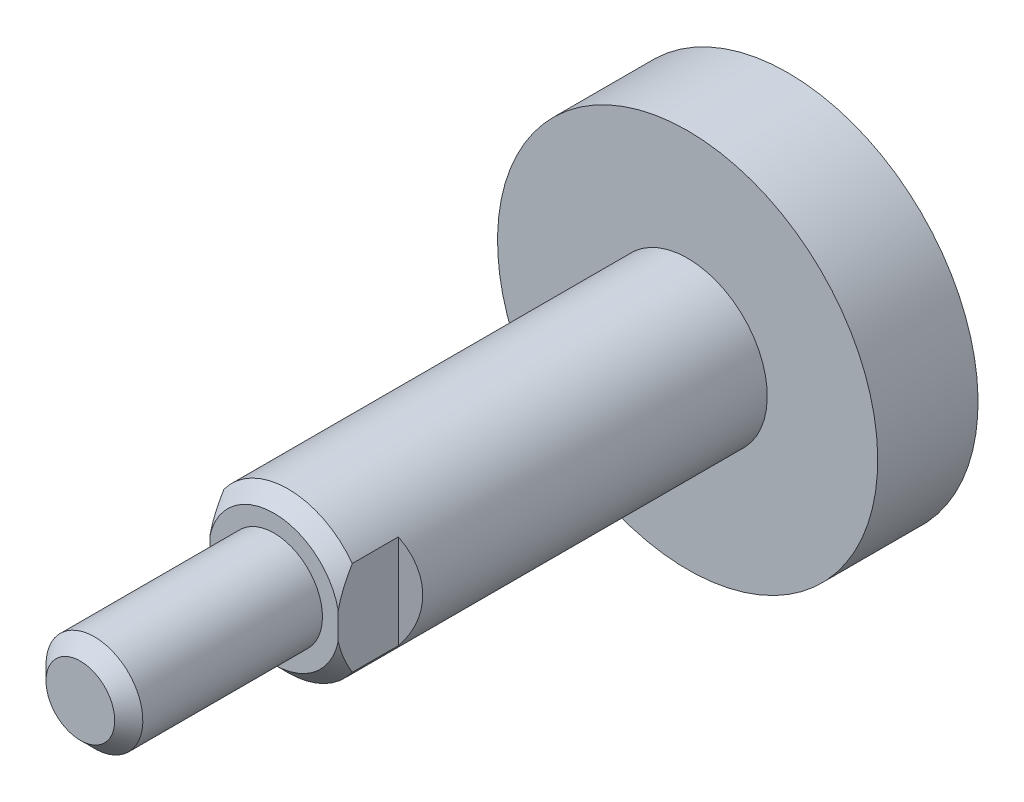
ISO-10303-21;
HEADER;
FILE_DESCRIPTION(('STEP AP214'),'2;1');
FILE_NAME('part.step','',(''),(''),'','','');
FILE_SCHEMA(('AUTOMOTIVE_DESIGN { 1 0 10303 214 1 1 1 1 }'));
ENDSEC;
DATA;
#1=APPLICATION_CONTEXT('core data for automotive mechanical design processes');
#2=APPLICATION_PROTOCOL_DEFINITION('international standard','automotive_design',2000,#1);
#3=PRODUCT_CONTEXT('',#1,'mechanical');
#4=PRODUCT('Part','Part','',(#3));
#5=PRODUCT_RELATED_PRODUCT_CATEGORY('part','',(#4));
#6=PRODUCT_DEFINITION_FORMATION('','',#4);
#7=PRODUCT_DEFINITION_CONTEXT('part definition',#1,'design');
#8=PRODUCT_DEFINITION('design','',#6,#7);
#9=PRODUCT_DEFINITION_SHAPE('','',#8);
#10=(LENGTH_UNIT() NAMED_UNIT(*) SI_UNIT(.MILLI.,.METRE.));
#11=(NAMED_UNIT(*) PLANE_ANGLE_UNIT() SI_UNIT($,.RADIAN.));
#12=(NAMED_UNIT(*) SI_UNIT($,.STERADIAN.) SOLID_ANGLE_UNIT());
#13=UNCERTAINTY_MEASURE_WITH_UNIT(LENGTH_MEASURE(1.E-05),#10,'distance_accuracy_value','');
#14=(GEOMETRIC_REPRESENTATION_CONTEXT(3) GLOBAL_UNCERTAINTY_ASSIGNED_CONTEXT((#13)) GLOBAL_UNIT_ASSIGNED_CONTEXT((#10,
#11,#12)) REPRESENTATION_CONTEXT('',''));
#15=CARTESIAN_POINT('',(0.,0.,0.));
#16=DIRECTION('',(0.,0.,1.));
#17=DIRECTION('',(1.,0.,0.));
#18=AXIS2_PLACEMENT_3D('',#15,#16,#17);
#19=CARTESIAN_POINT('',(0.,0.,35.266));
#20=DIRECTION('',(0.,0.,1.));
#21=DIRECTION('',(0.,-1.,0.));
#22=AXIS2_PLACEMENT_3D('',#19,#20,#21);
#23=PLANE('',#22);
#24=CARTESIAN_POINT('',(0.,0.,35.2659999999219));
#25=DIRECTION('',(0.,0.,-1.));
#26=DIRECTION('',(-1.,0.,0.));
#27=AXIS2_PLACEMENT_3D('',#24,#25,#26);
#28=CIRCLE('',#27,1.71299999999519);
#29=CARTESIAN_POINT('',(-1.71299999999519,0.,35.2659999999219));
#30=VERTEX_POINT('',#29);
#31=EDGE_CURVE('E20',#30,#30,#28,.T.);
#32=ORIENTED_EDGE('',*,*,#31,.F.);
#33=EDGE_LOOP('',(#32));
#34=FACE_BOUND('',#33,.T.);
#35=ADVANCED_FACE('F17',(#34),#23,.T.);
#36=CARTESIAN_POINT('',(0.,0.,34.5659999999839));
#37=DIRECTION('',(0.,0.,-1.));
#38=DIRECTION('',(-1.,0.,0.));
#39=AXIS2_PLACEMENT_3D('',#36,#37,#38);
#40=CONICAL_SURFACE('',#39,2.41299999993316,0.785398163397448);
#41=ORIENTED_EDGE('',*,*,#31,.T.);
#42=EDGE_LOOP('',(#41));
#43=FACE_BOUND('',#42,.T.);
#44=CARTESIAN_POINT('',(0.,0.,34.566));
#45=DIRECTION('',(0.,0.,-1.));
#46=DIRECTION('',(0.,1.,0.));
#47=AXIS2_PLACEMENT_3D('',#44,#45,#46);
#48=CIRCLE('',#47,2.413);
#49=CARTESIAN_POINT('',(0.,2.413,34.566));
#50=VERTEX_POINT('',#49);
#51=EDGE_CURVE('E72',#50,#50,#48,.T.);
#52=ORIENTED_EDGE('',*,*,#51,.F.);
#53=EDGE_LOOP('',(#52));
#54=FACE_BOUND('',#53,.T.);
#55=ADVANCED_FACE('F197',(#43,#54),#40,.T.);
#56=CARTESIAN_POINT('',(0.,0.,35.266));
#57=DIRECTION('',(0.,0.,-1.));
#58=DIRECTION('',(0.,1.,0.));
#59=AXIS2_PLACEMENT_3D('',#56,#57,#58);
#60=CYLINDRICAL_SURFACE('',#59,2.413);
#61=ORIENTED_EDGE('',*,*,#51,.T.);
#62=EDGE_LOOP('',(#61));
#63=FACE_BOUND('',#62,.T.);
#64=CARTESIAN_POINT('',(0.,0.,25.614));
#65=DIRECTION('',(0.,0.,-1.));
#66=DIRECTION('',(0.,1.,0.));
#67=AXIS2_PLACEMENT_3D('',#64,#65,#66);
#68=CIRCLE('',#67,2.413);
#69=CARTESIAN_POINT('',(0.,2.413,25.614));
#70=VERTEX_POINT('',#69);
#71=EDGE_CURVE('E71',#70,#70,#68,.F.);
#72=ORIENTED_EDGE('',*,*,#71,.T.);
#73=EDGE_LOOP('',(#72));
#74=FACE_BOUND('',#73,.T.);
#75=ADVANCED_FACE('F204',(#63,#74),#60,.T.);
#76=CARTESIAN_POINT('',(0.,0.,25.614));
#77=DIRECTION('',(0.,0.,-1.));
#78=DIRECTION('',(0.,1.,0.));
#79=AXIS2_PLACEMENT_3D('',#76,#77,#78);
#80=PLANE('',#79);
#81=ORIENTED_EDGE('',*,*,#71,.F.);
#82=EDGE_LOOP('',(#81));
#83=FACE_BOUND('',#82,.T.);
#84=DIRECTION('',(0.,1.,0.));
#85=VECTOR('',#84,1.);
#86=CARTESIAN_POINT('',(3.2,0.,25.614));
#87=LINE('',#86,#85);
#88=CARTESIAN_POINT('',(3.2,0.66810253703174,25.6140000000093));
#89=VERTEX_POINT('',#88);
#90=CARTESIAN_POINT('',(3.2,-0.668102537031729,25.6140000000093));
#91=VERTEX_POINT('',#90);
#92=EDGE_CURVE('E59',#89,#91,#87,.F.);
#93=ORIENTED_EDGE('',*,*,#92,.F.);
#94=CARTESIAN_POINT('',(0.,0.,25.6140000000187));
#95=DIRECTION('',(0.,0.,-1.));
#96=DIRECTION('',(0.,1.,0.));
#97=AXIS2_PLACEMENT_3D('',#94,#95,#96);
#98=CIRCLE('',#97,3.26899999998887);
#99=CARTESIAN_POINT('',(-3.2,0.668102537031733,25.6140000000093));
#100=VERTEX_POINT('',#99);
#101=EDGE_CURVE('E92',#100,#89,#98,.T.);
#102=ORIENTED_EDGE('',*,*,#101,.F.);
#103=DIRECTION('',(0.,1.,0.));
#104=VECTOR('',#103,1.);
#105=CARTESIAN_POINT('',(-3.2,-9.475,25.614));
#106=LINE('',#105,#104);
#107=CARTESIAN_POINT('',(-3.2,-0.668102537013458,25.6140000000131));
#108=VERTEX_POINT('',#107);
#109=EDGE_CURVE('E78',#100,#108,#106,.F.);
#110=ORIENTED_EDGE('',*,*,#109,.T.);
#111=CARTESIAN_POINT('',(0.,0.,25.6140000000187));
#112=DIRECTION('',(0.,0.,-1.));
#113=DIRECTION('',(0.,1.,0.));
#114=AXIS2_PLACEMENT_3D('',#111,#112,#113);
#115=CIRCLE('',#114,3.26899999998887);
#116=EDGE_CURVE('E76',#91,#108,#115,.T.);
#117=ORIENTED_EDGE('',*,*,#116,.F.);
#118=EDGE_LOOP('',(#93,#102,#110,#117));
#119=FACE_BOUND('',#118,.T.);
#120=ADVANCED_FACE('F77',(#83,#119),#80,.F.);
#121=CARTESIAN_POINT('',(0.,0.,24.9140000000807));
#122=DIRECTION('',(0.,0.,-1.));
#123=DIRECTION('',(0.,1.,0.));
#124=AXIS2_PLACEMENT_3D('',#121,#122,#123);
#125=CONICAL_SURFACE('',#124,3.96899999992684,0.785398163397448);
#126=CARTESIAN_POINT('',(-3.2,-0.668102537040877,25.6140000000075));
#127=CARTESIAN_POINT('',(-3.2,-0.791923989295427,25.5887118948215));
#128=CARTESIAN_POINT('',(-3.2,-0.91421443217869,25.5569533814341));
#129=CARTESIAN_POINT('',(-3.2,-1.15522323064115,25.4827867348097));
#130=CARTESIAN_POINT('',(-3.2,-1.27394966581364,25.4404051094269));
#131=CARTESIAN_POINT('',(-3.2,-1.50692397326224,25.3475394481761));
#132=CARTESIAN_POINT('',(-3.2,-1.62120166832552,25.2971285477306));
#133=CARTESIAN_POINT('',(-3.2,-1.84665634636372,25.1897204575844));
#134=CARTESIAN_POINT('',(-3.2,-1.95783200279579,25.1327205021723));
#135=CARTESIAN_POINT('',(-3.2,-2.11477722577384,25.0475447828539));
#136=CARTESIAN_POINT('',(-3.2,-2.1617013623651,25.0214620111321));
#137=CARTESIAN_POINT('',(-3.2,-2.25515024750113,24.9683835316657));
#138=CARTESIAN_POINT('',(-3.2,-2.30167405354123,24.9413861634533));
#139=CARTESIAN_POINT('',(-3.2,-2.34796954835779,24.9140000000056));
#140=B_SPLINE_CURVE_WITH_KNOTS('',3,(#126,#127,#128,#129,#130,#131,#132,#133,#134,#135,#136,
#137,#138,#139),.UNSPECIFIED.,.F.,.F.,(4,2,2,2,2,2,4),(0.,0.378663318902455,0.756391005201612,
1.13085654272106,1.50547983428745,1.66653163358814,1.82789340191387),.UNSPECIFIED.);
#141=CARTESIAN_POINT('',(-3.2,-2.34796954835613,24.9140000000028));
#142=VERTEX_POINT('',#141);
#143=EDGE_CURVE('E117',#108,#142,#140,.T.);
#144=ORIENTED_EDGE('',*,*,#143,.T.);
#145=CARTESIAN_POINT('',(0.,0.,24.914));
#146=DIRECTION('',(0.,0.,-1.));
#147=DIRECTION('',(0.,1.,0.));
#148=AXIS2_PLACEMENT_3D('',#145,#146,#147);
#149=CIRCLE('',#148,3.969);
#150=CARTESIAN_POINT('',(3.2,-2.34796954835614,24.9140000000028));
#151=VERTEX_POINT('',#150);
#152=EDGE_CURVE('E86',#151,#142,#149,.T.);
#153=ORIENTED_EDGE('',*,*,#152,.F.);
#154=CARTESIAN_POINT('',(3.2,-2.34796954835779,24.9140000000056));
#155=CARTESIAN_POINT('',(3.2,-2.28227540636543,24.9528576848515));
#156=CARTESIAN_POINT('',(3.2,-2.21612013327483,24.9909397042059));
#157=CARTESIAN_POINT('',(3.2,-2.08277615456897,25.0652931600532));
#158=CARTESIAN_POINT('',(3.2,-2.01558715528861,25.1015640691339));
#159=CARTESIAN_POINT('',(3.2,-1.81330543749888,25.2067462963329));
#160=CARTESIAN_POINT('',(3.2,-1.67658349378556,25.2725768397095));
#161=CARTESIAN_POINT('',(3.2,-1.39788707533627,25.3932563066724));
#162=CARTESIAN_POINT('',(3.2,-1.25590184063825,25.4480810761766));
#163=CARTESIAN_POINT('',(3.2,-0.966123687789918,25.543157171903));
#164=CARTESIAN_POINT('',(3.2,-0.818297789803371,25.5833066541195));
#165=CARTESIAN_POINT('',(3.2,-0.668102537040844,25.6140000000075));
#166=B_SPLINE_CURVE_WITH_KNOTS('',3,(#154,#155,#156,#157,#158,#159,#160,#161,#162,#163,#164,
#165),.UNSPECIFIED.,.F.,.F.,(4,2,2,2,2,4),(0.,0.228972156487763,0.458010607517,
0.912891486437008,1.36876002116515,1.82773469580356),.UNSPECIFIED.);
#167=EDGE_CURVE('E64',#151,#91,#166,.T.);
#168=ORIENTED_EDGE('',*,*,#167,.T.);
#169=ORIENTED_EDGE('',*,*,#116,.T.);
#170=EDGE_LOOP('',(#144,#153,#168,#169));
#171=FACE_BOUND('',#170,.T.);
#172=ADVANCED_FACE('F85',(#171),#125,.T.);
#173=CARTESIAN_POINT('',(3.2,-9.475,22.614));
#174=DIRECTION('',(-0.500000000000005,0.,-0.866025403784436));
#175=DIRECTION('',(-0.866025403784436,0.,0.500000000000005));
#176=AXIS2_PLACEMENT_3D('',#173,#174,#175);
#177=PLANE('',#176);
#178=CARTESIAN_POINT('',(0.,0.,24.4615208614068));
#179=DIRECTION('',(-0.500000000000005,0.,-0.866025403784436));
#180=DIRECTION('',(0.866025403784436,0.,-0.500000000000005));
#181=AXIS2_PLACEMENT_3D('',#178,#179,#180);
#182=ELLIPSE('',#181,4.58300643682726,3.969);
#183=CARTESIAN_POINT('',(3.2,2.3479695483545,22.614));
#184=VERTEX_POINT('',#183);
#185=CARTESIAN_POINT('',(3.2,-2.34796954835449,22.614));
#186=VERTEX_POINT('',#185);
#187=EDGE_CURVE('E176',#184,#186,#182,.T.);
#188=ORIENTED_EDGE('',*,*,#187,.F.);
#189=DIRECTION('',(0.,-1.,0.));
#190=VECTOR('',#189,1.);
#191=CARTESIAN_POINT('',(3.2,-9.475,22.614));
#192=LINE('',#191,#190);
#193=EDGE_CURVE('E87',#184,#186,#192,.T.);
#194=ORIENTED_EDGE('',*,*,#193,.T.);
#195=EDGE_LOOP('',(#188,#194));
#196=FACE_BOUND('',#195,.T.);
#197=ADVANCED_FACE('F112',(#196),#177,.F.);
#198=CARTESIAN_POINT('',(-3.2,-9.475,22.614));
#199=DIRECTION('',(0.500000000000003,0.,-0.866025403784437));
#200=DIRECTION('',(-0.866025403784437,0.,-0.500000000000003));
#201=AXIS2_PLACEMENT_3D('',#198,#199,#200);
#202=PLANE('',#201);
#203=CARTESIAN_POINT('',(0.,0.,24.4615208614068));
#204=DIRECTION('',(0.500000000000003,0.,-0.866025403784437));
#205=DIRECTION('',(-0.866025403784437,0.,-0.500000000000003));
#206=AXIS2_PLACEMENT_3D('',#203,#204,#205);
#207=ELLIPSE('',#206,4.58300643682726,3.969);
#208=CARTESIAN_POINT('',(-3.2,-2.34796954835448,22.614));
#209=VERTEX_POINT('',#208);
#210=CARTESIAN_POINT('',(-3.2,2.34796954835449,22.614));
#211=VERTEX_POINT('',#210);
#212=EDGE_CURVE('E173',#209,#211,#207,.T.);
#213=ORIENTED_EDGE('',*,*,#212,.F.);
#214=DIRECTION('',(0.,1.,0.));
#215=VECTOR('',#214,1.);
#216=CARTESIAN_POINT('',(-3.2,-9.475,22.614));
#217=LINE('',#216,#215);
#218=EDGE_CURVE('E82',#209,#211,#217,.T.);
#219=ORIENTED_EDGE('',*,*,#218,.T.);
#220=EDGE_LOOP('',(#213,#219));
#221=FACE_BOUND('',#220,.T.);
#222=ADVANCED_FACE('F130',(#221),#202,.F.);
#223=CARTESIAN_POINT('',(-3.2,-9.475,25.614));
#224=DIRECTION('',(1.,0.,0.));
#225=DIRECTION('',(0.,1.,0.));
#226=AXIS2_PLACEMENT_3D('',#223,#224,#225);
#227=PLANE('',#226);
#228=ORIENTED_EDGE('',*,*,#143,.F.);
#229=ORIENTED_EDGE('',*,*,#109,.F.);
#230=CARTESIAN_POINT('',(-3.2,2.34796954835963,24.9140000000045));
#231=CARTESIAN_POINT('',(-3.2,2.28227540636708,24.9528576848505));
#232=CARTESIAN_POINT('',(-3.2,2.21612013327628,24.9909397042051));
#233=CARTESIAN_POINT('',(-3.2,2.08277615457002,25.0652931600527));
#234=CARTESIAN_POINT('',(-3.2,2.01558715528946,25.1015640691335));
#235=CARTESIAN_POINT('',(-3.2,1.81330543749914,25.2067462963328));
#236=CARTESIAN_POINT('',(-3.2,1.67658349378541,25.2725768397096));
#237=CARTESIAN_POINT('',(-3.2,1.39788707533526,25.3932563066728));
#238=CARTESIAN_POINT('',(-3.2,1.25590184063679,25.4480810761771));
#239=CARTESIAN_POINT('',(-3.2,0.966123687787533,25.5431571719037));
#240=CARTESIAN_POINT('',(-3.2,0.818297789800503,25.5833066541203));
#241=CARTESIAN_POINT('',(-3.2,0.668102537037482,25.6140000000082));
#242=B_SPLINE_CURVE_WITH_KNOTS('',3,(#230,#231,#232,#233,#234,#235,#236,#237,#238,#239,#240,
#241),.UNSPECIFIED.,.F.,.F.,(4,2,2,2,2,4),(0.,0.228972156488461,0.458010607518398,
0.912891486439775,1.3687600211693,1.82773469580912),.UNSPECIFIED.);
#243=CARTESIAN_POINT('',(-3.2,2.3479695483545,24.9140000000038));
#244=VERTEX_POINT('',#243);
#245=EDGE_CURVE('E122',#244,#100,#242,.T.);
#246=ORIENTED_EDGE('',*,*,#245,.F.);
#247=DIRECTION('',(0.,0.,-1.));
#248=VECTOR('',#247,1.);
#249=CARTESIAN_POINT('',(-3.2,2.3479695483545,36.8400272581176));
#250=LINE('',#249,#248);
#251=EDGE_CURVE('E175',#211,#244,#250,.F.);
#252=ORIENTED_EDGE('',*,*,#251,.F.);
#253=ORIENTED_EDGE('',*,*,#218,.F.);
#254=DIRECTION('',(0.,0.,-1.));
#255=VECTOR('',#254,1.);
#256=CARTESIAN_POINT('',(-3.2,-2.34796954835448,36.8400272581176));
#257=LINE('',#256,#255);
#258=EDGE_CURVE('E178',#142,#209,#257,.T.);
#259=ORIENTED_EDGE('',*,*,#258,.F.);
#260=EDGE_LOOP('',(#228,#229,#246,#252,#253,#259));
#261=FACE_BOUND('',#260,.T.);
#262=ADVANCED_FACE('F126',(#261),#227,.F.);
#263=CARTESIAN_POINT('',(0.,0.,24.9140000000807));
#264=DIRECTION('',(0.,0.,-1.));
#265=DIRECTION('',(0.,1.,0.));
#266=AXIS2_PLACEMENT_3D('',#263,#264,#265);
#267=CONICAL_SURFACE('',#266,3.96899999992684,0.785398163397448);
#268=ORIENTED_EDGE('',*,*,#245,.T.);
#269=ORIENTED_EDGE('',*,*,#101,.T.);
#270=CARTESIAN_POINT('',(3.2,0.668102537040898,25.6140000000075));
#271=CARTESIAN_POINT('',(3.2,0.791923989295448,25.5887118948215));
#272=CARTESIAN_POINT('',(3.2,0.914214432178712,25.5569533814341));
#273=CARTESIAN_POINT('',(3.2,1.15522323064117,25.4827867348097));
#274=CARTESIAN_POINT('',(3.2,1.27394966581367,25.4404051094269));
#275=CARTESIAN_POINT('',(3.2,1.50692397326226,25.3475394481761));
#276=CARTESIAN_POINT('',(3.2,1.62120166832555,25.2971285477306));
#277=CARTESIAN_POINT('',(3.2,1.84665634636375,25.1897204575844));
#278=CARTESIAN_POINT('',(3.2,1.95783200279581,25.1327205021723));
#279=CARTESIAN_POINT('',(3.2,2.11477722577386,25.0475447828539));
#280=CARTESIAN_POINT('',(3.2,2.16170136236512,25.0214620111321));
#281=CARTESIAN_POINT('',(3.2,2.25515024750115,24.9683835316657));
#282=CARTESIAN_POINT('',(3.2,2.30167405354124,24.9413861634533));
#283=CARTESIAN_POINT('',(3.2,2.34796954835781,24.9140000000056));
#284=B_SPLINE_CURVE_WITH_KNOTS('',3,(#270,#271,#272,#273,#274,#275,#276,#277,#278,#279,#280,
#281,#282,#283),.UNSPECIFIED.,.F.,.F.,(4,2,2,2,2,2,4),(0.,0.378663318902457,0.756391005201615,
1.13085654272107,1.50547983428746,1.66653163358814,1.82789340191387),.UNSPECIFIED.);
#285=CARTESIAN_POINT('',(3.2,2.34796954835615,24.9140000000028));
#286=VERTEX_POINT('',#285);
#287=EDGE_CURVE('E67',#89,#286,#284,.T.);
#288=ORIENTED_EDGE('',*,*,#287,.T.);
#289=CARTESIAN_POINT('',(0.,0.,24.914));
#290=DIRECTION('',(0.,0.,-1.));
#291=DIRECTION('',(0.,1.,0.));
#292=AXIS2_PLACEMENT_3D('',#289,#290,#291);
#293=CIRCLE('',#292,3.969);
#294=EDGE_CURVE('E35',#244,#286,#293,.T.);
#295=ORIENTED_EDGE('',*,*,#294,.F.);
#296=EDGE_LOOP('',(#268,#269,#288,#295));
#297=FACE_BOUND('',#296,.T.);
#298=ADVANCED_FACE('F129',(#297),#267,.T.);
#299=CARTESIAN_POINT('',(3.2,-9.475,25.614));
#300=DIRECTION('',(-1.,0.,0.));
#301=DIRECTION('',(0.,-1.,0.));
#302=AXIS2_PLACEMENT_3D('',#299,#300,#301);
#303=PLANE('',#302);
#304=ORIENTED_EDGE('',*,*,#287,.F.);
#305=ORIENTED_EDGE('',*,*,#92,.T.);
#306=ORIENTED_EDGE('',*,*,#167,.F.);
#307=DIRECTION('',(0.,0.,-1.));
#308=VECTOR('',#307,1.);
#309=CARTESIAN_POINT('',(3.2,-2.34796954835449,36.8400272581176));
#310=LINE('',#309,#308);
#311=EDGE_CURVE('E89',#186,#151,#310,.F.);
#312=ORIENTED_EDGE('',*,*,#311,.F.);
#313=ORIENTED_EDGE('',*,*,#193,.F.);
#314=DIRECTION('',(0.,0.,-1.));
#315=VECTOR('',#314,1.);
#316=CARTESIAN_POINT('',(3.2,2.3479695483545,36.8400272581176));
#317=LINE('',#316,#315);
#318=EDGE_CURVE('E167',#286,#184,#317,.T.);
#319=ORIENTED_EDGE('',*,*,#318,.F.);
#320=EDGE_LOOP('',(#304,#305,#306,#312,#313,#319));
#321=FACE_BOUND('',#320,.T.);
#322=ADVANCED_FACE('F61',(#321),#303,.F.);
#323=CARTESIAN_POINT('',(0.,0.,36.8400272581176));
#324=DIRECTION('',(0.,0.,-1.));
#325=DIRECTION('',(0.,1.,0.));
#326=AXIS2_PLACEMENT_3D('',#323,#324,#325);
#327=CYLINDRICAL_SURFACE('',#326,3.969);
#328=CARTESIAN_POINT('',(0.,0.,5.));
#329=DIRECTION('',(0.,0.,-1.));
#330=DIRECTION('',(0.,1.,0.));
#331=AXIS2_PLACEMENT_3D('',#328,#329,#330);
#332=CIRCLE('',#331,3.969);
#333=CARTESIAN_POINT('',(0.,3.96900000000001,5.));
#334=VERTEX_POINT('',#333);
#335=EDGE_CURVE('E165',#334,#334,#332,.T.);
#336=ORIENTED_EDGE('',*,*,#335,.F.);
#337=EDGE_LOOP('',(#336));
#338=FACE_BOUND('',#337,.T.);
#339=ORIENTED_EDGE('',*,*,#294,.T.);
#340=ORIENTED_EDGE('',*,*,#318,.T.);
#341=ORIENTED_EDGE('',*,*,#187,.T.);
#342=ORIENTED_EDGE('',*,*,#311,.T.);
#343=ORIENTED_EDGE('',*,*,#152,.T.);
#344=ORIENTED_EDGE('',*,*,#258,.T.);
#345=ORIENTED_EDGE('',*,*,#212,.T.);
#346=ORIENTED_EDGE('',*,*,#251,.T.);
#347=EDGE_LOOP('',(#339,#340,#341,#342,#343,#344,#345,#346));
#348=FACE_BOUND('',#347,.T.);
#349=ADVANCED_FACE('F156',(#338,#348),#327,.T.);
#350=CARTESIAN_POINT('',(0.,0.,5.));
#351=DIRECTION('',(0.,0.,1.));
#352=DIRECTION('',(0.,-1.,0.));
#353=AXIS2_PLACEMENT_3D('',#350,#351,#352);
#354=PLANE('',#353);
#355=CARTESIAN_POINT('',(0.,0.,5.));
#356=DIRECTION('',(0.,0.,-1.));
#357=DIRECTION('',(0.,1.,0.));
#358=AXIS2_PLACEMENT_3D('',#355,#356,#357);
#359=CIRCLE('',#358,9.475);
#360=CARTESIAN_POINT('',(0.,9.475,5.));
#361=VERTEX_POINT('',#360);
#362=EDGE_CURVE('E26',#361,#361,#359,.T.);
#363=ORIENTED_EDGE('',*,*,#362,.F.);
#364=EDGE_LOOP('',(#363));
#365=FACE_BOUND('',#364,.T.);
#366=ORIENTED_EDGE('',*,*,#335,.T.);
#367=EDGE_LOOP('',(#366));
#368=FACE_BOUND('',#367,.T.);
#369=ADVANCED_FACE('F150',(#365,#368),#354,.T.);
#370=CARTESIAN_POINT('',(0.,0.,5.));
#371=DIRECTION('',(0.,0.,-1.));
#372=DIRECTION('',(0.,1.,0.));
#373=AXIS2_PLACEMENT_3D('',#370,#371,#372);
#374=CYLINDRICAL_SURFACE('',#373,9.475);
#375=ORIENTED_EDGE('',*,*,#362,.T.);
#376=EDGE_LOOP('',(#375));
#377=FACE_BOUND('',#376,.T.);
#378=CARTESIAN_POINT('',(0.,0.,0.));
#379=DIRECTION('',(0.,0.,-1.));
#380=DIRECTION('',(0.,1.,0.));
#381=AXIS2_PLACEMENT_3D('',#378,#379,#380);
#382=CIRCLE('',#381,9.475);
#383=CARTESIAN_POINT('',(0.,9.475,0.));
#384=VERTEX_POINT('',#383);
#385=EDGE_CURVE('E11',#384,#384,#382,.F.);
#386=ORIENTED_EDGE('',*,*,#385,.T.);
#387=EDGE_LOOP('',(#386));
#388=FACE_BOUND('',#387,.T.);
#389=ADVANCED_FACE('F144',(#377,#388),#374,.T.);
#390=CARTESIAN_POINT('',(0.,0.,0.));
#391=DIRECTION('',(0.,0.,1.));
#392=DIRECTION('',(0.,-1.,0.));
#393=AXIS2_PLACEMENT_3D('',#390,#391,#392);
#394=PLANE('',#393);
#395=ORIENTED_EDGE('',*,*,#385,.F.);
#396=EDGE_LOOP('',(#395));
#397=FACE_BOUND('',#396,.T.);
#398=ADVANCED_FACE('F142',(#397),#394,.F.);
#399=CLOSED_SHELL('',(#35,#55,#75,#120,#172,#197,#222,#262,#298,#322,#349,#369,#389,#398));
#400=MANIFOLD_SOLID_BREP('B1',#399);
#401=ADVANCED_BREP_SHAPE_REPRESENTATION('',(#18,#400),#14);
#402=SHAPE_DEFINITION_REPRESENTATION(#9,#401);
ENDSEC;
END-ISO-10303-21;
